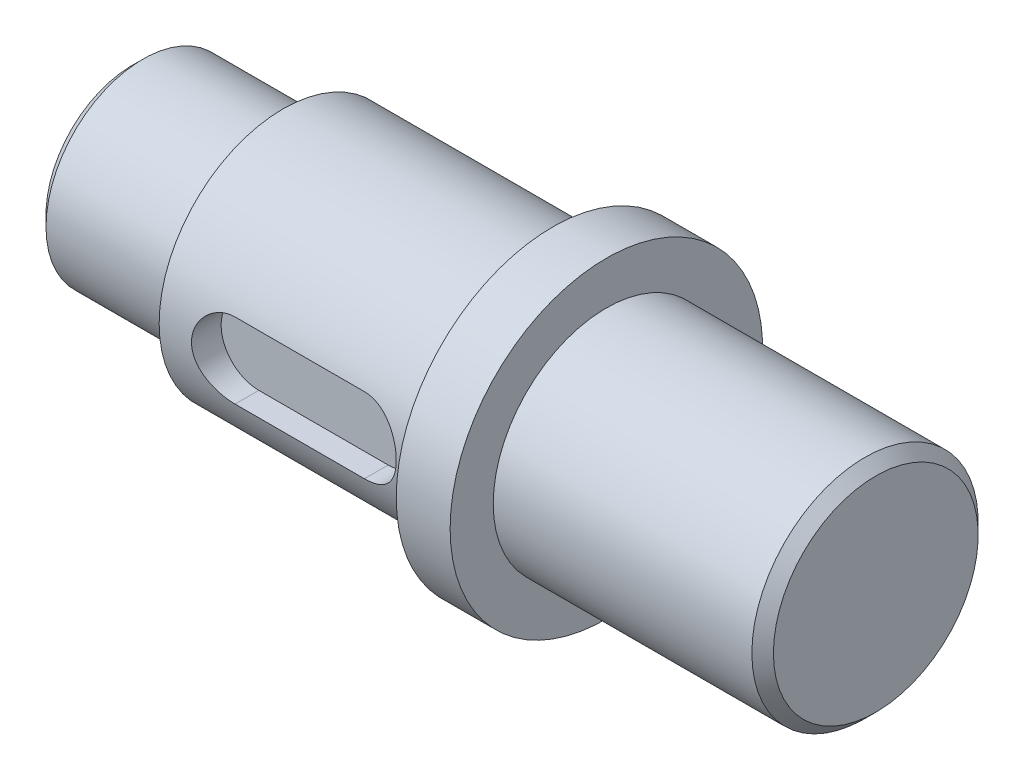
ISO-10303-21;
HEADER;
FILE_DESCRIPTION(('STEP AP214'),'2;1');
FILE_NAME('part.step','',(''),(''),'','','');
FILE_SCHEMA(('AUTOMOTIVE_DESIGN { 1 0 10303 214 1 1 1 1 }'));
ENDSEC;
DATA;
#1=APPLICATION_CONTEXT('core data for automotive mechanical design processes');
#2=APPLICATION_PROTOCOL_DEFINITION('international standard','automotive_design',2000,#1);
#3=PRODUCT_CONTEXT('',#1,'mechanical');
#4=PRODUCT('Part','Part','',(#3));
#5=PRODUCT_RELATED_PRODUCT_CATEGORY('part','',(#4));
#6=PRODUCT_DEFINITION_FORMATION('','',#4);
#7=PRODUCT_DEFINITION_CONTEXT('part definition',#1,'design');
#8=PRODUCT_DEFINITION('design','',#6,#7);
#9=PRODUCT_DEFINITION_SHAPE('','',#8);
#10=(LENGTH_UNIT() NAMED_UNIT(*) SI_UNIT(.MILLI.,.METRE.));
#11=(NAMED_UNIT(*) PLANE_ANGLE_UNIT() SI_UNIT($,.RADIAN.));
#12=(NAMED_UNIT(*) SI_UNIT($,.STERADIAN.) SOLID_ANGLE_UNIT());
#13=UNCERTAINTY_MEASURE_WITH_UNIT(LENGTH_MEASURE(1.E-05),#10,'distance_accuracy_value','');
#14=(GEOMETRIC_REPRESENTATION_CONTEXT(3) GLOBAL_UNCERTAINTY_ASSIGNED_CONTEXT((#13)) GLOBAL_UNIT_ASSIGNED_CONTEXT((#10,
#11,#12)) REPRESENTATION_CONTEXT('',''));
#15=CARTESIAN_POINT('',(0.,0.,0.));
#16=DIRECTION('',(0.,0.,1.));
#17=DIRECTION('',(1.,0.,0.));
#18=AXIS2_PLACEMENT_3D('',#15,#16,#17);
#19=CARTESIAN_POINT('',(0.,0.,0.));
#20=DIRECTION('',(1.,0.,0.));
#21=DIRECTION('',(0.,0.,-1.));
#22=AXIS2_PLACEMENT_3D('',#19,#20,#21);
#23=PLANE('',#22);
#24=CARTESIAN_POINT('',(0.,0.,0.));
#25=DIRECTION('',(1.,0.,0.));
#26=DIRECTION('',(0.,0.,-1.));
#27=AXIS2_PLACEMENT_3D('',#24,#25,#26);
#28=CIRCLE('',#27,16.);
#29=CARTESIAN_POINT('',(0.,0.,-16.));
#30=VERTEX_POINT('',#29);
#31=EDGE_CURVE('E64',#30,#30,#28,.F.);
#32=ORIENTED_EDGE('',*,*,#31,.T.);
#33=EDGE_LOOP('',(#32));
#34=FACE_BOUND('',#33,.T.);
#35=ADVANCED_FACE('F55',(#34),#23,.F.);
#36=CARTESIAN_POINT('',(0.,0.,0.));
#37=DIRECTION('',(-1.,0.,0.));
#38=DIRECTION('',(0.,0.,1.));
#39=AXIS2_PLACEMENT_3D('',#36,#37,#38);
#40=CYLINDRICAL_SURFACE('',#39,18.);
#41=CARTESIAN_POINT('',(2.00000000000003,0.,0.));
#42=DIRECTION('',(1.,0.,0.));
#43=DIRECTION('',(0.,0.,-1.));
#44=AXIS2_PLACEMENT_3D('',#41,#42,#43);
#45=CIRCLE('',#44,18.);
#46=CARTESIAN_POINT('',(2.00000000000003,0.,-18.));
#47=VERTEX_POINT('',#46);
#48=EDGE_CURVE('E11',#47,#47,#45,.T.);
#49=ORIENTED_EDGE('',*,*,#48,.T.);
#50=EDGE_LOOP('',(#49));
#51=FACE_BOUND('',#50,.T.);
#52=CARTESIAN_POINT('',(28.,0.,0.));
#53=DIRECTION('',(-1.,0.,0.));
#54=DIRECTION('',(0.,0.,1.));
#55=AXIS2_PLACEMENT_3D('',#52,#53,#54);
#56=CIRCLE('',#55,18.);
#57=CARTESIAN_POINT('',(28.,0.,18.));
#58=VERTEX_POINT('',#57);
#59=EDGE_CURVE('E142',#58,#58,#56,.T.);
#60=ORIENTED_EDGE('',*,*,#59,.T.);
#61=EDGE_LOOP('',(#60));
#62=FACE_BOUND('',#61,.T.);
#63=ADVANCED_FACE('F203',(#51,#62),#40,.T.);
#64=CARTESIAN_POINT('',(28.,18.,0.));
#65=DIRECTION('',(1.,0.,0.));
#66=DIRECTION('',(0.,0.,-1.));
#67=AXIS2_PLACEMENT_3D('',#64,#65,#66);
#68=PLANE('',#67);
#69=ORIENTED_EDGE('',*,*,#59,.F.);
#70=EDGE_LOOP('',(#69));
#71=FACE_BOUND('',#70,.T.);
#72=CARTESIAN_POINT('',(28.,0.,0.));
#73=DIRECTION('',(-1.,0.,0.));
#74=DIRECTION('',(0.,0.,1.));
#75=AXIS2_PLACEMENT_3D('',#72,#73,#74);
#76=CIRCLE('',#75,23.);
#77=CARTESIAN_POINT('',(28.,0.,23.));
#78=VERTEX_POINT('',#77);
#79=EDGE_CURVE('E139',#78,#78,#76,.T.);
#80=ORIENTED_EDGE('',*,*,#79,.T.);
#81=EDGE_LOOP('',(#80));
#82=FACE_BOUND('',#81,.T.);
#83=ADVANCED_FACE('F198',(#71,#82),#68,.F.);
#84=CARTESIAN_POINT('',(0.,0.,0.));
#85=DIRECTION('',(-1.,0.,0.));
#86=DIRECTION('',(0.,0.,1.));
#87=AXIS2_PLACEMENT_3D('',#84,#85,#86);
#88=CYLINDRICAL_SURFACE('',#87,23.);
#89=DIRECTION('',(-1.,0.,0.));
#90=VECTOR('',#89,1.);
#91=CARTESIAN_POINT('',(0.,7.,21.9089023002066));
#92=LINE('',#91,#90);
#93=CARTESIAN_POINT('',(41.,7.,21.9089023002066));
#94=VERTEX_POINT('',#93);
#95=CARTESIAN_POINT('',(65.,7.,21.9089023002066));
#96=VERTEX_POINT('',#95);
#97=EDGE_CURVE('E79',#94,#96,#92,.F.);
#98=ORIENTED_EDGE('',*,*,#97,.T.);
#99=CARTESIAN_POINT('',(65.,7.,21.9089023002066));
#100=CARTESIAN_POINT('',(65.1919716201408,7.00002616486259,21.9088742468493));
#101=CARTESIAN_POINT('',(65.383932984676,6.99210409971388,21.9114245166822));
#102=CARTESIAN_POINT('',(65.766387672268,6.96055738237966,21.9214767976885));
#103=CARTESIAN_POINT('',(65.9568813232755,6.93693634740016,21.9289776681892));
#104=CARTESIAN_POINT('',(66.3345545515332,6.87426641452478,21.9487009237173));
#105=CARTESIAN_POINT('',(66.5217414160267,6.83525751067094,21.9609110672293));
#106=CARTESIAN_POINT('',(66.8919888786808,6.74216659977085,21.9896697543328));
#107=CARTESIAN_POINT('',(67.0750493637499,6.68808418014662,22.0062184166734));
#108=CARTESIAN_POINT('',(67.4356851961424,6.56534080132967,22.0431485058268));
#109=CARTESIAN_POINT('',(67.6132638508924,6.49668883759621,22.0635275668093));
#110=CARTESIAN_POINT('',(67.9619696919128,6.34530364600972,22.1075402157766));
#111=CARTESIAN_POINT('',(68.133094448148,6.26256517767444,22.1311750143387));
#112=CARTESIAN_POINT('',(68.4677745541047,6.08362971854583,22.1810295300514));
#113=CARTESIAN_POINT('',(68.6313293444097,5.98743173520792,22.2072494377935));
#114=CARTESIAN_POINT('',(68.9499369669751,5.78220721942349,22.2615665896022));
#115=CARTESIAN_POINT('',(69.1049865505472,5.67317583440813,22.2896645420489));
#116=CARTESIAN_POINT('',(69.4099708422131,5.43967846416226,22.3478138913861));
#117=CARTESIAN_POINT('',(69.559626931886,5.31485664175637,22.3778983052687));
#118=CARTESIAN_POINT('',(69.8480274078536,5.05317305676467,22.4384375575819));
#119=CARTESIAN_POINT('',(69.9867679768824,4.9163071173681,22.468892521336));
#120=CARTESIAN_POINT('',(70.252407384843,4.63143020176048,22.529337578767));
#121=CARTESIAN_POINT('',(70.3793061365366,4.48341914345839,22.5593276690177));
#122=CARTESIAN_POINT('',(70.6204276594857,4.17717300815884,22.6180355075313));
#123=CARTESIAN_POINT('',(70.7346505326889,4.01893801340518,22.6467532660259));
#124=CARTESIAN_POINT('',(70.9519578964115,3.68970655519384,22.7027429974602));
#125=CARTESIAN_POINT('',(71.0547483950902,3.51850822923551,22.7299703243297));
#126=CARTESIAN_POINT('',(71.2454517573666,3.16767724648423,22.7815109061633));
#127=CARTESIAN_POINT('',(71.3333701317499,2.98804774547562,22.8058252395429));
#128=CARTESIAN_POINT('',(71.4936682899299,2.62150529652843,22.85086008399));
#129=CARTESIAN_POINT('',(71.5660452537229,2.4345910340204,22.871579942706));
#130=CARTESIAN_POINT('',(71.6945764818394,2.05494248256563,22.9088098417546));
#131=CARTESIAN_POINT('',(71.7507377887428,1.86221076047752,22.9253217092822));
#132=CARTESIAN_POINT('',(71.8449697723259,1.47796434054123,22.9532491306807));
#133=CARTESIAN_POINT('',(71.8835177479144,1.28657637076129,22.9647985639053));
#134=CARTESIAN_POINT('',(71.9444999285363,0.901099827345397,22.983151040643));
#135=CARTESIAN_POINT('',(71.9669405892824,0.707012367478287,22.9899559856864));
#136=CARTESIAN_POINT('',(71.9955205753606,0.317525687519932,22.9986330530892));
#137=CARTESIAN_POINT('',(72.001659482116,0.122126433875184,23.0005050487863));
#138=CARTESIAN_POINT('',(71.9975754864603,-0.268483171546141,22.9992621213358));
#139=CARTESIAN_POINT('',(71.9873528938992,-0.463693526829975,22.9961472926275));
#140=CARTESIAN_POINT('',(71.9512519041816,-0.846015430117989,22.985204395883));
#141=CARTESIAN_POINT('',(71.9259012758134,-1.0331816561994,22.9775352552369));
#142=CARTESIAN_POINT('',(71.8602062042682,-1.40469458172286,22.957818879164));
#143=CARTESIAN_POINT('',(71.8198566587571,-1.58904029943976,22.9457701539203));
#144=CARTESIAN_POINT('',(71.724524506151,-1.95352076054469,22.9176167810991));
#145=CARTESIAN_POINT('',(71.6695468187411,-2.13365689756803,22.901513497234));
#146=CARTESIAN_POINT('',(71.5453762735017,-2.48865936943677,22.8656602448231));
#147=CARTESIAN_POINT('',(71.476178068519,-2.66352369354769,22.8459089048306));
#148=CARTESIAN_POINT('',(71.3232370278943,-3.00877547469229,22.8030234611699));
#149=CARTESIAN_POINT('',(71.2393362338208,-3.17908842253821,22.7798531025066));
#150=CARTESIAN_POINT('',(71.058137953108,-3.51210942443171,22.7308914682017));
#151=CARTESIAN_POINT('',(70.9608358705138,-3.67481484373463,22.7050992942101));
#152=CARTESIAN_POINT('',(70.7535294564753,-3.99158228830782,22.6515579354661));
#153=CARTESIAN_POINT('',(70.6435249121624,-4.14564416866483,22.6238087179205));
#154=CARTESIAN_POINT('',(70.4115306864342,-4.44421879369354,22.5670560037249));
#155=CARTESIAN_POINT('',(70.2895406448118,-4.5887312511524,22.5380524693928));
#156=CARTESIAN_POINT('',(70.0292551316434,-4.87290232597466,22.4783614506758));
#157=CARTESIAN_POINT('',(69.8905043137551,-5.01213976984671,22.447652852665));
#158=CARTESIAN_POINT('',(69.6018031886609,-5.27844322057205,22.3865294385025));
#159=CARTESIAN_POINT('',(69.4518564852529,-5.4055131141851,22.3561145313456));
#160=CARTESIAN_POINT('',(69.1415634320091,-5.64677778602229,22.2963978947955));
#161=CARTESIAN_POINT('',(68.9812101951609,-5.7609638980677,22.2670969233643));
#162=CARTESIAN_POINT('',(68.6512723057109,-5.9755266711006,22.2104793271521));
#163=CARTESIAN_POINT('',(68.4816912798766,-6.07590870352314,22.183161932487));
#164=CARTESIAN_POINT('',(68.1324028585442,-6.26320647794986,22.1310145556715));
#165=CARTESIAN_POINT('',(67.9526039535245,-6.34996037384808,22.1062155500122));
#166=CARTESIAN_POINT('',(67.5859311127078,-6.50790217512866,22.0602351866644));
#167=CARTESIAN_POINT('',(67.3990601139677,-6.57909646100562,22.0390523468858));
#168=CARTESIAN_POINT('',(67.0197144107986,-6.7052714858454,22.0009927057726));
#169=CARTESIAN_POINT('',(66.8272458658624,-6.76026935686375,21.9841113570233));
#170=CARTESIAN_POINT('',(66.4380382523633,-6.85361765740659,21.9551885961934));
#171=CARTESIAN_POINT('',(66.2413011949014,-6.8919757552578,21.9431449548781));
#172=CARTESIAN_POINT('',(65.8706017593597,-6.94784133311629,21.9255166266569));
#173=CARTESIAN_POINT('',(65.69697569858,-6.96740036254035,21.9192991110038));
#174=CARTESIAN_POINT('',(65.3489041914375,-6.99347837577777,21.9109856850326));
#175=CARTESIAN_POINT('',(65.1744603041245,-7.00001628432424,21.9088837931937));
#176=CARTESIAN_POINT('',(65.,-7.,21.9089023002066));
#177=B_SPLINE_CURVE_WITH_KNOTS('',3,(#99,#100,#101,#102,#103,#104,#105,#106,#107,#108,#109,#110,
#111,#112,#113,#114,#115,#116,#117,#118,#119,#120,#121,#122,#123,#124,#125,#126,#127,#128,#129,
#130,#131,#132,#133,#134,#135,#136,#137,#138,#139,#140,#141,#142,#143,#144,#145,#146,#147,#148,
#149,#150,#151,#152,#153,#154,#155,#156,#157,#158,#159,#160,#161,#162,#163,#164,#165,#166,#167,
#168,#169,#170,#171,#172,#173,#174,#175,#176),.UNSPECIFIED.,.F.,.F.,(4,2,2,2,2,2,2,2,2,2,2,2,2,
2,2,2,2,2,2,2,2,2,2,2,2,2,2,2,2,2,2,2,2,2,2,2,2,2,4),(0.,0.575718721542308,1.15130483746701,
1.72540472248502,2.29952032276371,2.87328248120824,3.447258559787,4.02127698739529,
4.59551316449496,5.18639772647577,5.77748801653642,6.36858266078723,6.95967255072248,
7.56353406238462,8.1671713239246,8.77091802363767,9.374402115913,9.96038914463727,
10.5461411820249,11.1319082594977,11.7176642439907,12.2840904663197,12.8507095522104,
13.4171383151105,13.9837804557237,14.5569322725887,15.130281142867,15.7036396227567,
16.2770153393983,16.873179043779,17.4691516719338,18.0655228164103,18.6616612406634,
19.2644168854492,19.8669248938652,20.4687932801658,21.0703840040763,21.5943620102436,
22.1175779160176),.UNSPECIFIED.);
#178=CARTESIAN_POINT('',(65.,-7.,21.9089023002066));
#179=VERTEX_POINT('',#178);
#180=EDGE_CURVE('E145',#96,#179,#177,.T.);
#181=ORIENTED_EDGE('',*,*,#180,.T.);
#182=DIRECTION('',(-1.,0.,0.));
#183=VECTOR('',#182,1.);
#184=CARTESIAN_POINT('',(0.,-7.,21.9089023002066));
#185=LINE('',#184,#183);
#186=CARTESIAN_POINT('',(41.,-7.,21.9089023002066));
#187=VERTEX_POINT('',#186);
#188=EDGE_CURVE('E235',#179,#187,#185,.T.);
#189=ORIENTED_EDGE('',*,*,#188,.T.);
#190=CARTESIAN_POINT('',(41.,-7.,21.9089023002066));
#191=CARTESIAN_POINT('',(40.8080283798592,-7.00002616486259,21.9088742468493));
#192=CARTESIAN_POINT('',(40.616067015324,-6.99210409971388,21.9114245166822));
#193=CARTESIAN_POINT('',(40.233612327732,-6.96055738237966,21.9214767976885));
#194=CARTESIAN_POINT('',(40.0431186767245,-6.93693634740016,21.9289776681892));
#195=CARTESIAN_POINT('',(39.6654454484668,-6.87426641452478,21.9487009237173));
#196=CARTESIAN_POINT('',(39.4782585839733,-6.83525751067094,21.9609110672293));
#197=CARTESIAN_POINT('',(39.1080111213192,-6.74216659977084,21.9896697543328));
#198=CARTESIAN_POINT('',(38.9249506362501,-6.68808418014662,22.0062184166734));
#199=CARTESIAN_POINT('',(38.5643148038576,-6.56534080132967,22.0431485058268));
#200=CARTESIAN_POINT('',(38.3867361491076,-6.49668883759621,22.0635275668093));
#201=CARTESIAN_POINT('',(38.0380303080872,-6.34530364600972,22.1075402157766));
#202=CARTESIAN_POINT('',(37.866905551852,-6.26256517767444,22.1311750143387));
#203=CARTESIAN_POINT('',(37.5322254458953,-6.08362971854583,22.1810295300514));
#204=CARTESIAN_POINT('',(37.3686706555903,-5.98743173520792,22.2072494377935));
#205=CARTESIAN_POINT('',(37.0500630330249,-5.78220721942349,22.2615665896022));
#206=CARTESIAN_POINT('',(36.8950134494528,-5.67317583440813,22.2896645420489));
#207=CARTESIAN_POINT('',(36.5900291577869,-5.43967846416226,22.3478138913861));
#208=CARTESIAN_POINT('',(36.440373068114,-5.31485664175637,22.3778983052687));
#209=CARTESIAN_POINT('',(36.1519725921465,-5.05317305676467,22.4384375575819));
#210=CARTESIAN_POINT('',(36.0132320231176,-4.91630711736811,22.468892521336));
#211=CARTESIAN_POINT('',(35.747592615157,-4.63143020176049,22.529337578767));
#212=CARTESIAN_POINT('',(35.6206938634634,-4.48341914345839,22.5593276690177));
#213=CARTESIAN_POINT('',(35.3795723405143,-4.17717300815884,22.6180355075313));
#214=CARTESIAN_POINT('',(35.2653494673111,-4.01893801340518,22.6467532660259));
#215=CARTESIAN_POINT('',(35.0480421035885,-3.68970655519384,22.7027429974602));
#216=CARTESIAN_POINT('',(34.9452516049098,-3.51850822923551,22.7299703243297));
#217=CARTESIAN_POINT('',(34.7545482426334,-3.16767724648423,22.7815109061633));
#218=CARTESIAN_POINT('',(34.6666298682501,-2.98804774547562,22.8058252395429));
#219=CARTESIAN_POINT('',(34.5063317100701,-2.62150529652843,22.85086008399));
#220=CARTESIAN_POINT('',(34.4339547462771,-2.43459103402039,22.871579942706));
#221=CARTESIAN_POINT('',(34.3054235181606,-2.05494248256562,22.9088098417546));
#222=CARTESIAN_POINT('',(34.2492622112572,-1.86221076047751,22.9253217092822));
#223=CARTESIAN_POINT('',(34.1550302276741,-1.47796434054122,22.9532491306807));
#224=CARTESIAN_POINT('',(34.1164822520856,-1.28657637076129,22.9647985639053));
#225=CARTESIAN_POINT('',(34.0555000714637,-0.90109982734539,22.983151040643));
#226=CARTESIAN_POINT('',(34.0330594107177,-0.707012367478279,22.9899559856864));
#227=CARTESIAN_POINT('',(34.0044794246395,-0.317525687519923,22.9986330530892));
#228=CARTESIAN_POINT('',(33.998340517884,-0.122126433875174,23.0005050487863));
#229=CARTESIAN_POINT('',(34.0024245135397,0.268483171546151,22.9992621213358));
#230=CARTESIAN_POINT('',(34.0126471061009,0.463693526829985,22.9961472926275));
#231=CARTESIAN_POINT('',(34.0487480958184,0.846015430118001,22.985204395883));
#232=CARTESIAN_POINT('',(34.0740987241867,1.03318165619941,22.9775352552369));
#233=CARTESIAN_POINT('',(34.1397937957318,1.40469458172288,22.957818879164));
#234=CARTESIAN_POINT('',(34.1801433412429,1.58904029943977,22.9457701539203));
#235=CARTESIAN_POINT('',(34.275475493849,1.9535207605447,22.9176167810991));
#236=CARTESIAN_POINT('',(34.330453181259,2.13365689756804,22.901513497234));
#237=CARTESIAN_POINT('',(34.4546237264983,2.48865936943678,22.8656602448231));
#238=CARTESIAN_POINT('',(34.523821931481,2.6635236935477,22.8459089048306));
#239=CARTESIAN_POINT('',(34.6767629721057,3.0087754746923,22.8030234611699));
#240=CARTESIAN_POINT('',(34.7606637661792,3.17908842253823,22.7798531025066));
#241=CARTESIAN_POINT('',(34.9418620468921,3.51210942443173,22.7308914682017));
#242=CARTESIAN_POINT('',(35.0391641294862,3.67481484373465,22.7050992942101));
#243=CARTESIAN_POINT('',(35.2464705435247,3.99158228830785,22.6515579354661));
#244=CARTESIAN_POINT('',(35.3564750878377,4.14564416866485,22.6238087179205));
#245=CARTESIAN_POINT('',(35.5884693135658,4.44421879369356,22.5670560037249));
#246=CARTESIAN_POINT('',(35.7104593551883,4.58873125115242,22.5380524693928));
#247=CARTESIAN_POINT('',(35.9707448683566,4.87290232597467,22.4783614506758));
#248=CARTESIAN_POINT('',(36.1094956862449,5.01213976984673,22.447652852665));
#249=CARTESIAN_POINT('',(36.3981968113391,5.27844322057206,22.3865294385025));
#250=CARTESIAN_POINT('',(36.5481435147471,5.40551311418512,22.3561145313455));
#251=CARTESIAN_POINT('',(36.8584365679909,5.6467777860223,22.2963978947955));
#252=CARTESIAN_POINT('',(37.0187898048391,5.7609638980677,22.2670969233643));
#253=CARTESIAN_POINT('',(37.3487276942891,5.9755266711006,22.2104793271521));
#254=CARTESIAN_POINT('',(37.5183087201235,6.07590870352314,22.183161932487));
#255=CARTESIAN_POINT('',(37.8675971414558,6.26320647794987,22.1310145556715));
#256=CARTESIAN_POINT('',(38.0473960464756,6.34996037384809,22.1062155500122));
#257=CARTESIAN_POINT('',(38.4140688872922,6.50790217512867,22.0602351866644));
#258=CARTESIAN_POINT('',(38.6009398860324,6.57909646100562,22.0390523468858));
#259=CARTESIAN_POINT('',(38.9802855892014,6.7052714858454,22.0009927057726));
#260=CARTESIAN_POINT('',(39.1727541341376,6.76026935686375,21.9841113570233));
#261=CARTESIAN_POINT('',(39.5619617476367,6.85361765740659,21.9551885961934));
#262=CARTESIAN_POINT('',(39.7586988050986,6.89197575525781,21.9431449548781));
#263=CARTESIAN_POINT('',(40.1293982406403,6.94784133311629,21.9255166266569));
#264=CARTESIAN_POINT('',(40.30302430142,6.96740036254034,21.9192991110038));
#265=CARTESIAN_POINT('',(40.6510958085625,6.99347837577777,21.9109856850326));
#266=CARTESIAN_POINT('',(40.8255396958755,7.00001628432424,21.9088837931937));
#267=CARTESIAN_POINT('',(41.,7.,21.9089023002066));
#268=B_SPLINE_CURVE_WITH_KNOTS('',3,(#190,#191,#192,#193,#194,#195,#196,#197,#198,#199,#200,
#201,#202,#203,#204,#205,#206,#207,#208,#209,#210,#211,#212,#213,#214,#215,#216,#217,#218,#219,
#220,#221,#222,#223,#224,#225,#226,#227,#228,#229,#230,#231,#232,#233,#234,#235,#236,#237,#238,
#239,#240,#241,#242,#243,#244,#245,#246,#247,#248,#249,#250,#251,#252,#253,#254,#255,#256,#257,
#258,#259,#260,#261,#262,#263,#264,#265,#266,#267),.UNSPECIFIED.,.F.,.F.,(4,2,2,2,2,2,2,2,2,2,2,
2,2,2,2,2,2,2,2,2,2,2,2,2,2,2,2,2,2,2,2,2,2,2,2,2,2,2,4),(0.,0.575718721542315,1.15130483746703,
1.72540472248503,2.29952032276371,2.87328248120823,3.447258559787,4.02127698739529,
4.59551316449496,5.18639772647576,5.77748801653642,6.36858266078722,6.95967255072247,
7.56353406238462,8.1671713239246,8.77091802363767,9.37440211591301,9.96038914463728,
10.5461411820249,11.1319082594977,11.7176642439907,12.2840904663197,12.8507095522104,
13.4171383151105,13.9837804557237,14.5569322725888,15.1302811428671,15.7036396227567,
16.2770153393983,16.873179043779,17.4691516719338,18.0655228164103,18.6616612406634,
19.2644168854492,19.8669248938653,20.4687932801658,21.0703840040763,21.5943620102436,
22.1175779160176),.UNSPECIFIED.);
#269=EDGE_CURVE('E71',#187,#94,#268,.T.);
#270=ORIENTED_EDGE('',*,*,#269,.T.);
#271=EDGE_LOOP('',(#98,#181,#189,#270));
#272=FACE_BOUND('',#271,.T.);
#273=ORIENTED_EDGE('',*,*,#79,.F.);
#274=EDGE_LOOP('',(#273));
#275=FACE_BOUND('',#274,.T.);
#276=CARTESIAN_POINT('',(78.,0.,0.));
#277=DIRECTION('',(-1.,0.,0.));
#278=DIRECTION('',(0.,0.,1.));
#279=AXIS2_PLACEMENT_3D('',#276,#277,#278);
#280=CIRCLE('',#279,23.);
#281=CARTESIAN_POINT('',(78.,0.,23.));
#282=VERTEX_POINT('',#281);
#283=EDGE_CURVE('E136',#282,#282,#280,.T.);
#284=ORIENTED_EDGE('',*,*,#283,.T.);
#285=EDGE_LOOP('',(#284));
#286=FACE_BOUND('',#285,.T.);
#287=ADVANCED_FACE('F160',(#272,#275,#286),#88,.T.);
#288=CARTESIAN_POINT('',(78.,23.,0.));
#289=DIRECTION('',(1.,0.,0.));
#290=DIRECTION('',(0.,0.,-1.));
#291=AXIS2_PLACEMENT_3D('',#288,#289,#290);
#292=PLANE('',#291);
#293=ORIENTED_EDGE('',*,*,#283,.F.);
#294=EDGE_LOOP('',(#293));
#295=FACE_BOUND('',#294,.T.);
#296=CARTESIAN_POINT('',(78.,0.,0.));
#297=DIRECTION('',(-1.,0.,0.));
#298=DIRECTION('',(0.,0.,1.));
#299=AXIS2_PLACEMENT_3D('',#296,#297,#298);
#300=CIRCLE('',#299,29.);
#301=CARTESIAN_POINT('',(78.,0.,29.));
#302=VERTEX_POINT('',#301);
#303=EDGE_CURVE('E133',#302,#302,#300,.T.);
#304=ORIENTED_EDGE('',*,*,#303,.T.);
#305=EDGE_LOOP('',(#304));
#306=FACE_BOUND('',#305,.T.);
#307=ADVANCED_FACE('F190',(#295,#306),#292,.F.);
#308=CARTESIAN_POINT('',(0.,0.,0.));
#309=DIRECTION('',(-1.,0.,0.));
#310=DIRECTION('',(0.,0.,1.));
#311=AXIS2_PLACEMENT_3D('',#308,#309,#310);
#312=CYLINDRICAL_SURFACE('',#311,29.);
#313=ORIENTED_EDGE('',*,*,#303,.F.);
#314=EDGE_LOOP('',(#313));
#315=FACE_BOUND('',#314,.T.);
#316=CARTESIAN_POINT('',(88.,0.,0.));
#317=DIRECTION('',(-1.,0.,0.));
#318=DIRECTION('',(0.,0.,1.));
#319=AXIS2_PLACEMENT_3D('',#316,#317,#318);
#320=CIRCLE('',#319,29.);
#321=CARTESIAN_POINT('',(88.,0.,29.));
#322=VERTEX_POINT('',#321);
#323=EDGE_CURVE('E130',#322,#322,#320,.T.);
#324=ORIENTED_EDGE('',*,*,#323,.T.);
#325=EDGE_LOOP('',(#324));
#326=FACE_BOUND('',#325,.T.);
#327=ADVANCED_FACE('F187',(#315,#326),#312,.T.);
#328=CARTESIAN_POINT('',(88.,29.,0.));
#329=DIRECTION('',(-1.,0.,0.));
#330=DIRECTION('',(0.,0.,1.));
#331=AXIS2_PLACEMENT_3D('',#328,#329,#330);
#332=PLANE('',#331);
#333=ORIENTED_EDGE('',*,*,#323,.F.);
#334=EDGE_LOOP('',(#333));
#335=FACE_BOUND('',#334,.T.);
#336=CARTESIAN_POINT('',(88.,0.,0.));
#337=DIRECTION('',(-1.,0.,0.));
#338=DIRECTION('',(0.,0.,1.));
#339=AXIS2_PLACEMENT_3D('',#336,#337,#338);
#340=CIRCLE('',#339,21.);
#341=CARTESIAN_POINT('',(88.,0.,21.));
#342=VERTEX_POINT('',#341);
#343=EDGE_CURVE('E124',#342,#342,#340,.T.);
#344=ORIENTED_EDGE('',*,*,#343,.T.);
#345=EDGE_LOOP('',(#344));
#346=FACE_BOUND('',#345,.T.);
#347=ADVANCED_FACE('F183',(#335,#346),#332,.F.);
#348=CARTESIAN_POINT('',(0.,0.,0.));
#349=DIRECTION('',(-1.,0.,0.));
#350=DIRECTION('',(0.,0.,1.));
#351=AXIS2_PLACEMENT_3D('',#348,#349,#350);
#352=CYLINDRICAL_SURFACE('',#351,21.);
#353=CARTESIAN_POINT('',(136.,0.,0.));
#354=DIRECTION('',(-1.,0.,0.));
#355=DIRECTION('',(0.,0.,1.));
#356=AXIS2_PLACEMENT_3D('',#353,#354,#355);
#357=CIRCLE('',#356,21.);
#358=CARTESIAN_POINT('',(136.,0.,21.));
#359=VERTEX_POINT('',#358);
#360=EDGE_CURVE('E232',#359,#359,#357,.T.);
#361=ORIENTED_EDGE('',*,*,#360,.T.);
#362=EDGE_LOOP('',(#361));
#363=FACE_BOUND('',#362,.T.);
#364=ORIENTED_EDGE('',*,*,#343,.F.);
#365=EDGE_LOOP('',(#364));
#366=FACE_BOUND('',#365,.T.);
#367=ADVANCED_FACE('F179',(#363,#366),#352,.T.);
#368=CARTESIAN_POINT('',(138.,21.,0.));
#369=DIRECTION('',(-1.,0.,0.));
#370=DIRECTION('',(0.,0.,1.));
#371=AXIS2_PLACEMENT_3D('',#368,#369,#370);
#372=PLANE('',#371);
#373=CARTESIAN_POINT('',(138.,0.,0.));
#374=DIRECTION('',(-1.,0.,0.));
#375=DIRECTION('',(0.,0.,1.));
#376=AXIS2_PLACEMENT_3D('',#373,#374,#375);
#377=CIRCLE('',#376,18.9999999999999);
#378=CARTESIAN_POINT('',(138.,0.,18.9999999999999));
#379=VERTEX_POINT('',#378);
#380=EDGE_CURVE('E229',#379,#379,#377,.F.);
#381=ORIENTED_EDGE('',*,*,#380,.T.);
#382=EDGE_LOOP('',(#381));
#383=FACE_BOUND('',#382,.T.);
#384=ADVANCED_FACE('F176',(#383),#372,.F.);
#385=CARTESIAN_POINT('',(41.,0.,17.5));
#386=DIRECTION('',(0.,0.,1.));
#387=DIRECTION('',(1.,0.,0.));
#388=AXIS2_PLACEMENT_3D('',#385,#386,#387);
#389=CYLINDRICAL_SURFACE('',#388,7.);
#390=DIRECTION('',(0.,0.,1.));
#391=VECTOR('',#390,1.);
#392=CARTESIAN_POINT('',(41.,-7.,17.5));
#393=LINE('',#392,#391);
#394=CARTESIAN_POINT('',(41.,-7.,17.5));
#395=VERTEX_POINT('',#394);
#396=EDGE_CURVE('E96',#395,#187,#393,.T.);
#397=ORIENTED_EDGE('',*,*,#396,.F.);
#398=CARTESIAN_POINT('',(41.,0.,17.5));
#399=DIRECTION('',(0.,0.,1.));
#400=DIRECTION('',(1.,0.,0.));
#401=AXIS2_PLACEMENT_3D('',#398,#399,#400);
#402=CIRCLE('',#401,7.);
#403=CARTESIAN_POINT('',(41.,7.,17.5));
#404=VERTEX_POINT('',#403);
#405=EDGE_CURVE('E100',#404,#395,#402,.T.);
#406=ORIENTED_EDGE('',*,*,#405,.F.);
#407=DIRECTION('',(0.,0.,1.));
#408=VECTOR('',#407,1.);
#409=CARTESIAN_POINT('',(41.,7.,17.5));
#410=LINE('',#409,#408);
#411=EDGE_CURVE('E122',#404,#94,#410,.T.);
#412=ORIENTED_EDGE('',*,*,#411,.T.);
#413=ORIENTED_EDGE('',*,*,#269,.F.);
#414=EDGE_LOOP('',(#397,#406,#412,#413));
#415=FACE_BOUND('',#414,.T.);
#416=ADVANCED_FACE('F98',(#415),#389,.F.);
#417=CARTESIAN_POINT('',(41.,7.,17.5));
#418=DIRECTION('',(0.,1.,0.));
#419=DIRECTION('',(-1.,0.,0.));
#420=AXIS2_PLACEMENT_3D('',#417,#418,#419);
#421=PLANE('',#420);
#422=ORIENTED_EDGE('',*,*,#411,.F.);
#423=DIRECTION('',(-1.,0.,0.));
#424=VECTOR('',#423,1.);
#425=CARTESIAN_POINT('',(41.,7.,17.5));
#426=LINE('',#425,#424);
#427=CARTESIAN_POINT('',(65.,7.,17.5));
#428=VERTEX_POINT('',#427);
#429=EDGE_CURVE('E105',#428,#404,#426,.T.);
#430=ORIENTED_EDGE('',*,*,#429,.F.);
#431=DIRECTION('',(0.,0.,1.));
#432=VECTOR('',#431,1.);
#433=CARTESIAN_POINT('',(65.,7.,17.5));
#434=LINE('',#433,#432);
#435=EDGE_CURVE('E125',#428,#96,#434,.T.);
#436=ORIENTED_EDGE('',*,*,#435,.T.);
#437=ORIENTED_EDGE('',*,*,#97,.F.);
#438=EDGE_LOOP('',(#422,#430,#436,#437));
#439=FACE_BOUND('',#438,.T.);
#440=ADVANCED_FACE('F169',(#439),#421,.F.);
#441=CARTESIAN_POINT('',(65.,0.,17.5));
#442=DIRECTION('',(0.,0.,1.));
#443=DIRECTION('',(1.,0.,0.));
#444=AXIS2_PLACEMENT_3D('',#441,#442,#443);
#445=CYLINDRICAL_SURFACE('',#444,7.);
#446=ORIENTED_EDGE('',*,*,#435,.F.);
#447=CARTESIAN_POINT('',(65.,0.,17.5));
#448=DIRECTION('',(0.,0.,1.));
#449=DIRECTION('',(1.,0.,0.));
#450=AXIS2_PLACEMENT_3D('',#447,#448,#449);
#451=CIRCLE('',#450,7.);
#452=CARTESIAN_POINT('',(65.,-7.,17.5));
#453=VERTEX_POINT('',#452);
#454=EDGE_CURVE('E114',#453,#428,#451,.T.);
#455=ORIENTED_EDGE('',*,*,#454,.F.);
#456=DIRECTION('',(0.,0.,1.));
#457=VECTOR('',#456,1.);
#458=CARTESIAN_POINT('',(65.,-7.,17.5));
#459=LINE('',#458,#457);
#460=EDGE_CURVE('E104',#453,#179,#459,.T.);
#461=ORIENTED_EDGE('',*,*,#460,.T.);
#462=ORIENTED_EDGE('',*,*,#180,.F.);
#463=EDGE_LOOP('',(#446,#455,#461,#462));
#464=FACE_BOUND('',#463,.T.);
#465=ADVANCED_FACE('F164',(#464),#445,.F.);
#466=CARTESIAN_POINT('',(41.,-7.,17.5));
#467=DIRECTION('',(0.,-1.,0.));
#468=DIRECTION('',(0.,0.,-1.));
#469=AXIS2_PLACEMENT_3D('',#466,#467,#468);
#470=PLANE('',#469);
#471=ORIENTED_EDGE('',*,*,#460,.F.);
#472=DIRECTION('',(1.,0.,0.));
#473=VECTOR('',#472,1.);
#474=CARTESIAN_POINT('',(41.,-7.,17.5));
#475=LINE('',#474,#473);
#476=EDGE_CURVE('E108',#395,#453,#475,.T.);
#477=ORIENTED_EDGE('',*,*,#476,.F.);
#478=ORIENTED_EDGE('',*,*,#396,.T.);
#479=ORIENTED_EDGE('',*,*,#188,.F.);
#480=EDGE_LOOP('',(#471,#477,#478,#479));
#481=FACE_BOUND('',#480,.T.);
#482=ADVANCED_FACE('F109',(#481),#470,.F.);
#483=CARTESIAN_POINT('',(41.,0.,17.5));
#484=DIRECTION('',(0.,0.,1.));
#485=DIRECTION('',(1.,0.,0.));
#486=AXIS2_PLACEMENT_3D('',#483,#484,#485);
#487=PLANE('',#486);
#488=ORIENTED_EDGE('',*,*,#405,.T.);
#489=ORIENTED_EDGE('',*,*,#476,.T.);
#490=ORIENTED_EDGE('',*,*,#454,.T.);
#491=ORIENTED_EDGE('',*,*,#429,.T.);
#492=EDGE_LOOP('',(#488,#489,#490,#491));
#493=FACE_BOUND('',#492,.T.);
#494=ADVANCED_FACE('F116',(#493),#487,.T.);
#495=CARTESIAN_POINT('',(136.,0.,0.));
#496=DIRECTION('',(-1.,0.,0.));
#497=DIRECTION('',(0.,0.,1.));
#498=AXIS2_PLACEMENT_3D('',#495,#496,#497);
#499=CONICAL_SURFACE('',#498,21.,0.785398163397447);
#500=ORIENTED_EDGE('',*,*,#380,.F.);
#501=EDGE_LOOP('',(#500));
#502=FACE_BOUND('',#501,.T.);
#503=ORIENTED_EDGE('',*,*,#360,.F.);
#504=EDGE_LOOP('',(#503));
#505=FACE_BOUND('',#504,.T.);
#506=ADVANCED_FACE('F215',(#502,#505),#499,.T.);
#507=CARTESIAN_POINT('',(0.,0.,0.));
#508=DIRECTION('',(1.,0.,0.));
#509=DIRECTION('',(0.,0.,-1.));
#510=AXIS2_PLACEMENT_3D('',#507,#508,#509);
#511=CONICAL_SURFACE('',#510,16.,0.785398163397443);
#512=ORIENTED_EDGE('',*,*,#48,.F.);
#513=EDGE_LOOP('',(#512));
#514=FACE_BOUND('',#513,.T.);
#515=ORIENTED_EDGE('',*,*,#31,.F.);
#516=EDGE_LOOP('',(#515));
#517=FACE_BOUND('',#516,.T.);
#518=ADVANCED_FACE('F58',(#514,#517),#511,.T.);
#519=CLOSED_SHELL('',(#35,#63,#83,#287,#307,#327,#347,#367,#384,#416,#440,#465,#482,#494,#506,#518));
#520=MANIFOLD_SOLID_BREP('B2',#519);
#521=ADVANCED_BREP_SHAPE_REPRESENTATION('',(#18,#520),#14);
#522=SHAPE_DEFINITION_REPRESENTATION(#9,#521);
ENDSEC;
END-ISO-10303-21;
